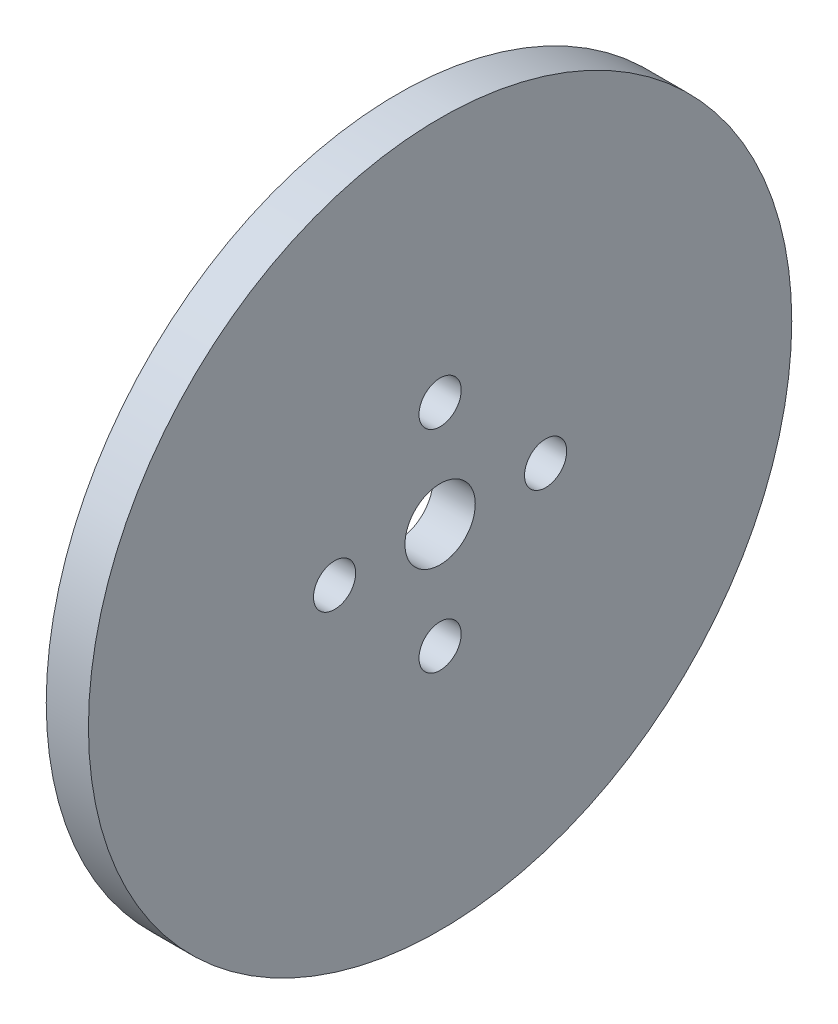
ISO-10303-21;
HEADER;
FILE_DESCRIPTION(('STEP AP214'),'2;1');
FILE_NAME('part.step','',(''),(''),'','','');
FILE_SCHEMA(('AUTOMOTIVE_DESIGN { 1 0 10303 214 1 1 1 1 }'));
ENDSEC;
DATA;
#1=APPLICATION_CONTEXT('core data for automotive mechanical design processes');
#2=APPLICATION_PROTOCOL_DEFINITION('international standard','automotive_design',2000,#1);
#3=PRODUCT_CONTEXT('',#1,'mechanical');
#4=PRODUCT('Part','Part','',(#3));
#5=PRODUCT_RELATED_PRODUCT_CATEGORY('part','',(#4));
#6=PRODUCT_DEFINITION_FORMATION('','',#4);
#7=PRODUCT_DEFINITION_CONTEXT('part definition',#1,'design');
#8=PRODUCT_DEFINITION('design','',#6,#7);
#9=PRODUCT_DEFINITION_SHAPE('','',#8);
#10=(LENGTH_UNIT() NAMED_UNIT(*) SI_UNIT(.MILLI.,.METRE.));
#11=(NAMED_UNIT(*) PLANE_ANGLE_UNIT() SI_UNIT($,.RADIAN.));
#12=(NAMED_UNIT(*) SI_UNIT($,.STERADIAN.) SOLID_ANGLE_UNIT());
#13=UNCERTAINTY_MEASURE_WITH_UNIT(LENGTH_MEASURE(1.E-05),#10,'distance_accuracy_value','');
#14=(GEOMETRIC_REPRESENTATION_CONTEXT(3) GLOBAL_UNCERTAINTY_ASSIGNED_CONTEXT((#13)) GLOBAL_UNIT_ASSIGNED_CONTEXT((#10,
#11,#12)) REPRESENTATION_CONTEXT('',''));
#15=CARTESIAN_POINT('',(0.,0.,0.));
#16=DIRECTION('',(0.,0.,1.));
#17=DIRECTION('',(1.,0.,0.));
#18=AXIS2_PLACEMENT_3D('',#15,#16,#17);
#19=CARTESIAN_POINT('',(3.,0.,0.));
#20=DIRECTION('',(1.,0.,0.));
#21=DIRECTION('',(0.,0.,-1.));
#22=AXIS2_PLACEMENT_3D('',#19,#20,#21);
#23=PLANE('',#22);
#24=CARTESIAN_POINT('',(3.,-7.5,-8.48058857415318E-13));
#25=DIRECTION('',(1.,0.,0.));
#26=DIRECTION('',(0.,0.,-1.));
#27=AXIS2_PLACEMENT_3D('',#24,#25,#26);
#28=CIRCLE('',#27,1.5);
#29=CARTESIAN_POINT('',(3.,-7.5,-1.50000000000085));
#30=VERTEX_POINT('',#29);
#31=EDGE_CURVE('E58',#30,#30,#28,.T.);
#32=ORIENTED_EDGE('',*,*,#31,.F.);
#33=EDGE_LOOP('',(#32));
#34=FACE_BOUND('',#33,.T.);
#35=CARTESIAN_POINT('',(3.,7.5,0.));
#36=DIRECTION('',(1.,0.,0.));
#37=DIRECTION('',(0.,0.,-1.));
#38=AXIS2_PLACEMENT_3D('',#35,#36,#37);
#39=CIRCLE('',#38,1.5);
#40=CARTESIAN_POINT('',(3.,7.5,-1.5));
#41=VERTEX_POINT('',#40);
#42=EDGE_CURVE('E46',#41,#41,#39,.T.);
#43=ORIENTED_EDGE('',*,*,#42,.F.);
#44=EDGE_LOOP('',(#43));
#45=FACE_BOUND('',#44,.T.);
#46=CARTESIAN_POINT('',(3.,0.,0.));
#47=DIRECTION('',(1.,0.,0.));
#48=DIRECTION('',(0.,0.,-1.));
#49=AXIS2_PLACEMENT_3D('',#46,#47,#48);
#50=CIRCLE('',#49,25.);
#51=CARTESIAN_POINT('',(3.,0.,-25.));
#52=VERTEX_POINT('',#51);
#53=EDGE_CURVE('E10',#52,#52,#50,.T.);
#54=ORIENTED_EDGE('',*,*,#53,.T.);
#55=EDGE_LOOP('',(#54));
#56=FACE_BOUND('',#55,.T.);
#57=CARTESIAN_POINT('',(3.,0.,0.));
#58=DIRECTION('',(1.,0.,0.));
#59=DIRECTION('',(0.,0.,-1.));
#60=AXIS2_PLACEMENT_3D('',#57,#58,#59);
#61=CIRCLE('',#60,2.5);
#62=CARTESIAN_POINT('',(3.,0.,-2.5));
#63=VERTEX_POINT('',#62);
#64=EDGE_CURVE('E41',#63,#63,#61,.T.);
#65=ORIENTED_EDGE('',*,*,#64,.F.);
#66=EDGE_LOOP('',(#65));
#67=FACE_BOUND('',#66,.T.);
#68=CARTESIAN_POINT('',(3.,4.24029428707659E-13,-7.50000000000042));
#69=DIRECTION('',(1.,0.,0.));
#70=DIRECTION('',(0.,0.,-1.));
#71=AXIS2_PLACEMENT_3D('',#68,#69,#70);
#72=CIRCLE('',#71,1.5);
#73=CARTESIAN_POINT('',(3.,4.24029428707659E-13,-9.00000000000042));
#74=VERTEX_POINT('',#73);
#75=EDGE_CURVE('E52',#74,#74,#72,.T.);
#76=ORIENTED_EDGE('',*,*,#75,.F.);
#77=EDGE_LOOP('',(#76));
#78=FACE_BOUND('',#77,.T.);
#79=CARTESIAN_POINT('',(3.,-4.24947913807019E-13,7.49999999999958));
#80=DIRECTION('',(1.,0.,0.));
#81=DIRECTION('',(0.,0.,-1.));
#82=AXIS2_PLACEMENT_3D('',#79,#80,#81);
#83=CIRCLE('',#82,1.5);
#84=CARTESIAN_POINT('',(3.,-4.24947913807019E-13,5.99999999999958));
#85=VERTEX_POINT('',#84);
#86=EDGE_CURVE('E64',#85,#85,#83,.T.);
#87=ORIENTED_EDGE('',*,*,#86,.F.);
#88=EDGE_LOOP('',(#87));
#89=FACE_BOUND('',#88,.T.);
#90=ADVANCED_FACE('F30',(#34,#45,#56,#67,#78,#89),#23,.T.);
#91=CARTESIAN_POINT('',(0.,0.,0.));
#92=DIRECTION('',(1.,0.,0.));
#93=DIRECTION('',(0.,0.,-1.));
#94=AXIS2_PLACEMENT_3D('',#91,#92,#93);
#95=PLANE('',#94);
#96=CARTESIAN_POINT('',(0.,-7.5,-8.48058857415318E-13));
#97=DIRECTION('',(1.,0.,0.));
#98=DIRECTION('',(0.,0.,-1.));
#99=AXIS2_PLACEMENT_3D('',#96,#97,#98);
#100=CIRCLE('',#99,1.5);
#101=CARTESIAN_POINT('',(0.,-7.5,-1.50000000000085));
#102=VERTEX_POINT('',#101);
#103=EDGE_CURVE('E61',#102,#102,#100,.T.);
#104=ORIENTED_EDGE('',*,*,#103,.T.);
#105=EDGE_LOOP('',(#104));
#106=FACE_BOUND('',#105,.T.);
#107=CARTESIAN_POINT('',(0.,7.5,0.));
#108=DIRECTION('',(1.,0.,0.));
#109=DIRECTION('',(0.,0.,-1.));
#110=AXIS2_PLACEMENT_3D('',#107,#108,#109);
#111=CIRCLE('',#110,1.5);
#112=CARTESIAN_POINT('',(0.,7.5,-1.5));
#113=VERTEX_POINT('',#112);
#114=EDGE_CURVE('E49',#113,#113,#111,.T.);
#115=ORIENTED_EDGE('',*,*,#114,.T.);
#116=EDGE_LOOP('',(#115));
#117=FACE_BOUND('',#116,.T.);
#118=CARTESIAN_POINT('',(0.,0.,0.));
#119=DIRECTION('',(1.,0.,0.));
#120=DIRECTION('',(0.,0.,-1.));
#121=AXIS2_PLACEMENT_3D('',#118,#119,#120);
#122=CIRCLE('',#121,25.);
#123=CARTESIAN_POINT('',(0.,0.,-25.));
#124=VERTEX_POINT('',#123);
#125=EDGE_CURVE('E34',#124,#124,#122,.T.);
#126=ORIENTED_EDGE('',*,*,#125,.F.);
#127=EDGE_LOOP('',(#126));
#128=FACE_BOUND('',#127,.T.);
#129=CARTESIAN_POINT('',(0.,0.,0.));
#130=DIRECTION('',(1.,0.,0.));
#131=DIRECTION('',(0.,0.,-1.));
#132=AXIS2_PLACEMENT_3D('',#129,#130,#131);
#133=CIRCLE('',#132,2.5);
#134=CARTESIAN_POINT('',(0.,0.,-2.5));
#135=VERTEX_POINT('',#134);
#136=EDGE_CURVE('E43',#135,#135,#133,.T.);
#137=ORIENTED_EDGE('',*,*,#136,.T.);
#138=EDGE_LOOP('',(#137));
#139=FACE_BOUND('',#138,.T.);
#140=CARTESIAN_POINT('',(0.,4.24029428707659E-13,-7.50000000000042));
#141=DIRECTION('',(1.,0.,0.));
#142=DIRECTION('',(0.,0.,-1.));
#143=AXIS2_PLACEMENT_3D('',#140,#141,#142);
#144=CIRCLE('',#143,1.5);
#145=CARTESIAN_POINT('',(0.,4.24029428707659E-13,-9.00000000000042));
#146=VERTEX_POINT('',#145);
#147=EDGE_CURVE('E55',#146,#146,#144,.T.);
#148=ORIENTED_EDGE('',*,*,#147,.T.);
#149=EDGE_LOOP('',(#148));
#150=FACE_BOUND('',#149,.T.);
#151=CARTESIAN_POINT('',(0.,-4.24947913807019E-13,7.49999999999958));
#152=DIRECTION('',(1.,0.,0.));
#153=DIRECTION('',(0.,0.,-1.));
#154=AXIS2_PLACEMENT_3D('',#151,#152,#153);
#155=CIRCLE('',#154,1.5);
#156=CARTESIAN_POINT('',(0.,-4.24947913807019E-13,5.99999999999958));
#157=VERTEX_POINT('',#156);
#158=EDGE_CURVE('E67',#157,#157,#155,.T.);
#159=ORIENTED_EDGE('',*,*,#158,.T.);
#160=EDGE_LOOP('',(#159));
#161=FACE_BOUND('',#160,.T.);
#162=ADVANCED_FACE('F77',(#106,#117,#128,#139,#150,#161),#95,.F.);
#163=CARTESIAN_POINT('',(3.,0.,0.));
#164=DIRECTION('',(-1.,0.,0.));
#165=DIRECTION('',(0.,0.,1.));
#166=AXIS2_PLACEMENT_3D('',#163,#164,#165);
#167=CYLINDRICAL_SURFACE('',#166,25.);
#168=ORIENTED_EDGE('',*,*,#53,.F.);
#169=EDGE_LOOP('',(#168));
#170=FACE_BOUND('',#169,.T.);
#171=ORIENTED_EDGE('',*,*,#125,.T.);
#172=EDGE_LOOP('',(#171));
#173=FACE_BOUND('',#172,.T.);
#174=ADVANCED_FACE('F32',(#170,#173),#167,.T.);
#175=CARTESIAN_POINT('',(3.,0.,0.));
#176=DIRECTION('',(-1.,0.,0.));
#177=DIRECTION('',(0.,0.,1.));
#178=AXIS2_PLACEMENT_3D('',#175,#176,#177);
#179=CYLINDRICAL_SURFACE('',#178,2.5);
#180=ORIENTED_EDGE('',*,*,#64,.T.);
#181=EDGE_LOOP('',(#180));
#182=FACE_BOUND('',#181,.T.);
#183=ORIENTED_EDGE('',*,*,#136,.F.);
#184=EDGE_LOOP('',(#183));
#185=FACE_BOUND('',#184,.T.);
#186=ADVANCED_FACE('F87',(#182,#185),#179,.F.);
#187=CARTESIAN_POINT('',(3.,7.5,0.));
#188=DIRECTION('',(-1.,0.,0.));
#189=DIRECTION('',(0.,0.,1.));
#190=AXIS2_PLACEMENT_3D('',#187,#188,#189);
#191=CYLINDRICAL_SURFACE('',#190,1.5);
#192=ORIENTED_EDGE('',*,*,#42,.T.);
#193=EDGE_LOOP('',(#192));
#194=FACE_BOUND('',#193,.T.);
#195=ORIENTED_EDGE('',*,*,#114,.F.);
#196=EDGE_LOOP('',(#195));
#197=FACE_BOUND('',#196,.T.);
#198=ADVANCED_FACE('F90',(#194,#197),#191,.F.);
#199=CARTESIAN_POINT('',(3.,4.24029428707659E-13,-7.50000000000042));
#200=DIRECTION('',(-1.,0.,0.));
#201=DIRECTION('',(0.,0.,1.));
#202=AXIS2_PLACEMENT_3D('',#199,#200,#201);
#203=CYLINDRICAL_SURFACE('',#202,1.5);
#204=ORIENTED_EDGE('',*,*,#75,.T.);
#205=EDGE_LOOP('',(#204));
#206=FACE_BOUND('',#205,.T.);
#207=ORIENTED_EDGE('',*,*,#147,.F.);
#208=EDGE_LOOP('',(#207));
#209=FACE_BOUND('',#208,.T.);
#210=ADVANCED_FACE('F94',(#206,#209),#203,.F.);
#211=CARTESIAN_POINT('',(3.,-7.5,-8.48058857415318E-13));
#212=DIRECTION('',(-1.,0.,0.));
#213=DIRECTION('',(0.,0.,1.));
#214=AXIS2_PLACEMENT_3D('',#211,#212,#213);
#215=CYLINDRICAL_SURFACE('',#214,1.5);
#216=ORIENTED_EDGE('',*,*,#31,.T.);
#217=EDGE_LOOP('',(#216));
#218=FACE_BOUND('',#217,.T.);
#219=ORIENTED_EDGE('',*,*,#103,.F.);
#220=EDGE_LOOP('',(#219));
#221=FACE_BOUND('',#220,.T.);
#222=ADVANCED_FACE('F98',(#218,#221),#215,.F.);
#223=CARTESIAN_POINT('',(3.,-4.24947913807019E-13,7.49999999999958));
#224=DIRECTION('',(-1.,0.,0.));
#225=DIRECTION('',(0.,0.,1.));
#226=AXIS2_PLACEMENT_3D('',#223,#224,#225);
#227=CYLINDRICAL_SURFACE('',#226,1.5);
#228=ORIENTED_EDGE('',*,*,#86,.T.);
#229=EDGE_LOOP('',(#228));
#230=FACE_BOUND('',#229,.T.);
#231=ORIENTED_EDGE('',*,*,#158,.F.);
#232=EDGE_LOOP('',(#231));
#233=FACE_BOUND('',#232,.T.);
#234=ADVANCED_FACE('F73',(#230,#233),#227,.F.);
#235=CLOSED_SHELL('',(#90,#162,#174,#186,#198,#210,#222,#234));
#236=MANIFOLD_SOLID_BREP('B2',#235);
#237=ADVANCED_BREP_SHAPE_REPRESENTATION('',(#18,#236),#14);
#238=SHAPE_DEFINITION_REPRESENTATION(#9,#237);
ENDSEC;
END-ISO-10303-21;
